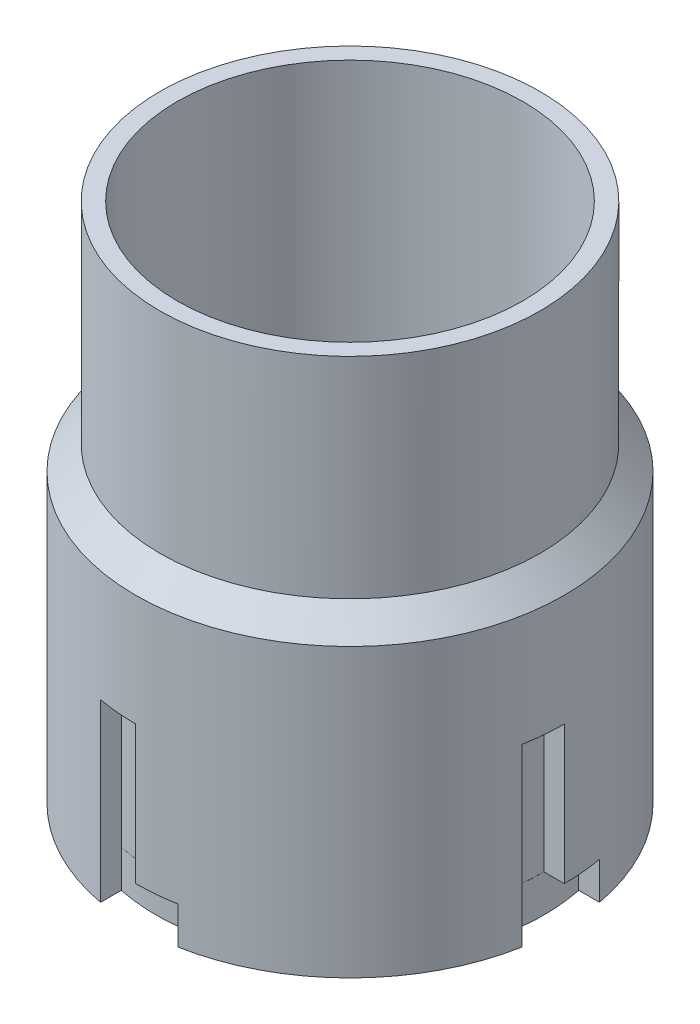
ISO-10303-21;
HEADER;
FILE_DESCRIPTION(('STEP AP214'),'2;1');
FILE_NAME('part.step','',(''),(''),'','','');
FILE_SCHEMA(('AUTOMOTIVE_DESIGN { 1 0 10303 214 1 1 1 1 }'));
ENDSEC;
DATA;
#1=APPLICATION_CONTEXT('core data for automotive mechanical design processes');
#2=APPLICATION_PROTOCOL_DEFINITION('international standard','automotive_design',2000,#1);
#3=PRODUCT_CONTEXT('',#1,'mechanical');
#4=PRODUCT('Part','Part','',(#3));
#5=PRODUCT_RELATED_PRODUCT_CATEGORY('part','',(#4));
#6=PRODUCT_DEFINITION_FORMATION('','',#4);
#7=PRODUCT_DEFINITION_CONTEXT('part definition',#1,'design');
#8=PRODUCT_DEFINITION('design','',#6,#7);
#9=PRODUCT_DEFINITION_SHAPE('','',#8);
#10=(LENGTH_UNIT() NAMED_UNIT(*) SI_UNIT(.MILLI.,.METRE.));
#11=(NAMED_UNIT(*) PLANE_ANGLE_UNIT() SI_UNIT($,.RADIAN.));
#12=(NAMED_UNIT(*) SI_UNIT($,.STERADIAN.) SOLID_ANGLE_UNIT());
#13=UNCERTAINTY_MEASURE_WITH_UNIT(LENGTH_MEASURE(1.E-05),#10,'distance_accuracy_value','');
#14=(GEOMETRIC_REPRESENTATION_CONTEXT(3) GLOBAL_UNCERTAINTY_ASSIGNED_CONTEXT((#13)) GLOBAL_UNIT_ASSIGNED_CONTEXT((#10,
#11,#12)) REPRESENTATION_CONTEXT('',''));
#15=CARTESIAN_POINT('',(0.,0.,0.));
#16=DIRECTION('',(0.,0.,1.));
#17=DIRECTION('',(1.,0.,0.));
#18=AXIS2_PLACEMENT_3D('',#15,#16,#17);
#19=CARTESIAN_POINT('',(0.,101.6,0.));
#20=DIRECTION('',(0.,-1.,0.));
#21=DIRECTION('',(0.,0.,-1.));
#22=AXIS2_PLACEMENT_3D('',#19,#20,#21);
#23=CYLINDRICAL_SURFACE('',#22,39.37);
#24=CARTESIAN_POINT('',(0.,58.5799999999999,0.));
#25=DIRECTION('',(0.,1.,0.));
#26=DIRECTION('',(0.,0.,1.));
#27=AXIS2_PLACEMENT_3D('',#24,#25,#26);
#28=CIRCLE('',#27,39.37);
#29=CARTESIAN_POINT('',(0.,58.5799999999999,39.37));
#30=VERTEX_POINT('',#29);
#31=EDGE_CURVE('E41',#30,#30,#28,.F.);
#32=ORIENTED_EDGE('',*,*,#31,.T.);
#33=EDGE_LOOP('',(#32));
#34=FACE_BOUND('',#33,.T.);
#35=DIRECTION('',(0.,-1.,0.));
#36=VECTOR('',#35,1.);
#37=CARTESIAN_POINT('',(-38.7222979173499,12.7,-7.11199999999987));
#38=LINE('',#37,#36);
#39=CARTESIAN_POINT('',(-38.7222979173499,38.1,-7.11199999999987));
#40=VERTEX_POINT('',#39);
#41=CARTESIAN_POINT('',(-38.7222979173499,5.842,-7.11199999999987));
#42=VERTEX_POINT('',#41);
#43=EDGE_CURVE('E48',#40,#42,#38,.T.);
#44=ORIENTED_EDGE('',*,*,#43,.F.);
#45=CARTESIAN_POINT('',(0.,38.1,0.));
#46=DIRECTION('',(0.,-1.,0.));
#47=DIRECTION('',(-1.,0.,0.));
#48=AXIS2_PLACEMENT_3D('',#45,#46,#47);
#49=CIRCLE('',#48,39.37);
#50=CARTESIAN_POINT('',(-39.37,38.1,1.37459620310254E-13));
#51=VERTEX_POINT('',#50);
#52=EDGE_CURVE('E239',#51,#40,#49,.T.);
#53=ORIENTED_EDGE('',*,*,#52,.F.);
#54=DIRECTION('',(0.,-1.,0.));
#55=VECTOR('',#54,1.);
#56=CARTESIAN_POINT('',(-39.37,38.1,1.37459620310254E-13));
#57=LINE('',#56,#55);
#58=CARTESIAN_POINT('',(-39.37,12.7,1.37459620310254E-13));
#59=VERTEX_POINT('',#58);
#60=EDGE_CURVE('E229',#51,#59,#57,.T.);
#61=ORIENTED_EDGE('',*,*,#60,.T.);
#62=CARTESIAN_POINT('',(0.,12.7,0.));
#63=DIRECTION('',(0.,-1.,0.));
#64=DIRECTION('',(0.,0.,-1.));
#65=AXIS2_PLACEMENT_3D('',#62,#63,#64);
#66=CIRCLE('',#65,39.37);
#67=CARTESIAN_POINT('',(-38.7222979173499,12.7,7.11200000000013));
#68=VERTEX_POINT('',#67);
#69=EDGE_CURVE('E452',#68,#59,#66,.T.);
#70=ORIENTED_EDGE('',*,*,#69,.F.);
#71=DIRECTION('',(0.,-1.,0.));
#72=VECTOR('',#71,1.);
#73=CARTESIAN_POINT('',(-38.7222979173499,12.7,7.11200000000013));
#74=LINE('',#73,#72);
#75=CARTESIAN_POINT('',(-38.7222979173499,5.842,7.11200000000013));
#76=VERTEX_POINT('',#75);
#77=EDGE_CURVE('E312',#68,#76,#74,.T.);
#78=ORIENTED_EDGE('',*,*,#77,.T.);
#79=CARTESIAN_POINT('',(0.,5.842,0.));
#80=DIRECTION('',(0.,-1.,0.));
#81=DIRECTION('',(0.,0.,-1.));
#82=AXIS2_PLACEMENT_3D('',#79,#80,#81);
#83=CIRCLE('',#82,39.37);
#84=CARTESIAN_POINT('',(-7.112,5.842,38.7222979173499));
#85=VERTEX_POINT('',#84);
#86=EDGE_CURVE('E877',#85,#76,#83,.T.);
#87=ORIENTED_EDGE('',*,*,#86,.F.);
#88=DIRECTION('',(0.,-1.,0.));
#89=VECTOR('',#88,1.);
#90=CARTESIAN_POINT('',(-7.112,12.7,38.7222979173499));
#91=LINE('',#90,#89);
#92=CARTESIAN_POINT('',(-7.112,38.1,38.7222979173499));
#93=VERTEX_POINT('',#92);
#94=EDGE_CURVE('E56',#93,#85,#91,.T.);
#95=ORIENTED_EDGE('',*,*,#94,.F.);
#96=CARTESIAN_POINT('',(0.,38.1,0.));
#97=DIRECTION('',(0.,-1.,0.));
#98=DIRECTION('',(0.,0.,1.));
#99=AXIS2_PLACEMENT_3D('',#96,#97,#98);
#100=CIRCLE('',#99,39.37);
#101=CARTESIAN_POINT('',(0.,38.1,39.37));
#102=VERTEX_POINT('',#101);
#103=EDGE_CURVE('E262',#102,#93,#100,.T.);
#104=ORIENTED_EDGE('',*,*,#103,.F.);
#105=DIRECTION('',(0.,-1.,0.));
#106=VECTOR('',#105,1.);
#107=CARTESIAN_POINT('',(0.,38.1,39.37));
#108=LINE('',#107,#106);
#109=CARTESIAN_POINT('',(0.,12.7,39.37));
#110=VERTEX_POINT('',#109);
#111=EDGE_CURVE('E277',#102,#110,#108,.T.);
#112=ORIENTED_EDGE('',*,*,#111,.T.);
#113=CARTESIAN_POINT('',(0.,12.7,0.));
#114=DIRECTION('',(0.,-1.,0.));
#115=DIRECTION('',(0.,0.,-1.));
#116=AXIS2_PLACEMENT_3D('',#113,#114,#115);
#117=CIRCLE('',#116,39.37);
#118=CARTESIAN_POINT('',(7.112,12.7,38.7222979173499));
#119=VERTEX_POINT('',#118);
#120=EDGE_CURVE('E449',#119,#110,#117,.T.);
#121=ORIENTED_EDGE('',*,*,#120,.F.);
#122=DIRECTION('',(0.,-1.,0.));
#123=VECTOR('',#122,1.);
#124=CARTESIAN_POINT('',(7.112,12.7,38.7222979173499));
#125=LINE('',#124,#123);
#126=CARTESIAN_POINT('',(7.112,5.842,38.7222979173499));
#127=VERTEX_POINT('',#126);
#128=EDGE_CURVE('E329',#119,#127,#125,.T.);
#129=ORIENTED_EDGE('',*,*,#128,.T.);
#130=CARTESIAN_POINT('',(38.72229791735,5.842,7.1119999999996));
#131=VERTEX_POINT('',#130);
#132=EDGE_CURVE('E393',#131,#127,#83,.T.);
#133=ORIENTED_EDGE('',*,*,#132,.F.);
#134=DIRECTION('',(0.,-1.,0.));
#135=VECTOR('',#134,1.);
#136=CARTESIAN_POINT('',(38.72229791735,12.7,7.1119999999996));
#137=LINE('',#136,#135);
#138=CARTESIAN_POINT('',(38.72229791735,38.1,7.1119999999996));
#139=VERTEX_POINT('',#138);
#140=EDGE_CURVE('E344',#139,#131,#137,.T.);
#141=ORIENTED_EDGE('',*,*,#140,.F.);
#142=CARTESIAN_POINT('',(0.,38.1,0.));
#143=DIRECTION('',(0.,-1.,0.));
#144=DIRECTION('',(1.,0.,0.));
#145=AXIS2_PLACEMENT_3D('',#142,#143,#144);
#146=CIRCLE('',#145,39.37);
#147=CARTESIAN_POINT('',(39.37,38.1,-4.12378860930763E-13));
#148=VERTEX_POINT('',#147);
#149=EDGE_CURVE('E288',#148,#139,#146,.T.);
#150=ORIENTED_EDGE('',*,*,#149,.F.);
#151=DIRECTION('',(0.,-1.,0.));
#152=VECTOR('',#151,1.);
#153=CARTESIAN_POINT('',(39.37,38.1,-4.12378860930763E-13));
#154=LINE('',#153,#152);
#155=CARTESIAN_POINT('',(39.37,12.7,-4.12378860930763E-13));
#156=VERTEX_POINT('',#155);
#157=EDGE_CURVE('E302',#148,#156,#154,.T.);
#158=ORIENTED_EDGE('',*,*,#157,.T.);
#159=CARTESIAN_POINT('',(0.,12.7,0.));
#160=DIRECTION('',(0.,-1.,0.));
#161=DIRECTION('',(0.,0.,-1.));
#162=AXIS2_PLACEMENT_3D('',#159,#160,#161);
#163=CIRCLE('',#162,39.37);
#164=CARTESIAN_POINT('',(38.7222979173498,12.7,-7.1120000000004));
#165=VERTEX_POINT('',#164);
#166=EDGE_CURVE('E446',#165,#156,#163,.T.);
#167=ORIENTED_EDGE('',*,*,#166,.F.);
#168=DIRECTION('',(0.,-1.,0.));
#169=VECTOR('',#168,1.);
#170=CARTESIAN_POINT('',(38.7222979173498,12.7,-7.1120000000004));
#171=LINE('',#170,#169);
#172=CARTESIAN_POINT('',(38.7222979173498,5.842,-7.1120000000004));
#173=VERTEX_POINT('',#172);
#174=EDGE_CURVE('E345',#165,#173,#171,.T.);
#175=ORIENTED_EDGE('',*,*,#174,.T.);
#176=CARTESIAN_POINT('',(7.112,5.842,-38.7222979173499));
#177=VERTEX_POINT('',#176);
#178=EDGE_CURVE('E389',#177,#173,#83,.T.);
#179=ORIENTED_EDGE('',*,*,#178,.F.);
#180=DIRECTION('',(0.,-1.,0.));
#181=VECTOR('',#180,1.);
#182=CARTESIAN_POINT('',(7.112,12.7,-38.7222979173499));
#183=LINE('',#182,#181);
#184=CARTESIAN_POINT('',(7.112,38.1,-38.7222979173499));
#185=VERTEX_POINT('',#184);
#186=EDGE_CURVE('E403',#185,#177,#183,.T.);
#187=ORIENTED_EDGE('',*,*,#186,.F.);
#188=CARTESIAN_POINT('',(0.,38.1,0.));
#189=DIRECTION('',(0.,-1.,0.));
#190=DIRECTION('',(0.,0.,-1.));
#191=AXIS2_PLACEMENT_3D('',#188,#189,#190);
#192=CIRCLE('',#191,39.37);
#193=CARTESIAN_POINT('',(0.,38.1,-39.37));
#194=VERTEX_POINT('',#193);
#195=EDGE_CURVE('E362',#194,#185,#192,.T.);
#196=ORIENTED_EDGE('',*,*,#195,.F.);
#197=DIRECTION('',(0.,-1.,0.));
#198=VECTOR('',#197,1.);
#199=CARTESIAN_POINT('',(0.,38.1,-39.37));
#200=LINE('',#199,#198);
#201=CARTESIAN_POINT('',(0.,12.7,-39.37));
#202=VERTEX_POINT('',#201);
#203=EDGE_CURVE('E375',#194,#202,#200,.T.);
#204=ORIENTED_EDGE('',*,*,#203,.T.);
#205=CARTESIAN_POINT('',(0.,12.7,0.));
#206=DIRECTION('',(0.,-1.,0.));
#207=DIRECTION('',(0.,0.,-1.));
#208=AXIS2_PLACEMENT_3D('',#205,#206,#207);
#209=CIRCLE('',#208,39.37);
#210=CARTESIAN_POINT('',(-7.112,12.7,-38.7222979173499));
#211=VERTEX_POINT('',#210);
#212=EDGE_CURVE('E421',#211,#202,#209,.T.);
#213=ORIENTED_EDGE('',*,*,#212,.F.);
#214=DIRECTION('',(0.,-1.,0.));
#215=VECTOR('',#214,1.);
#216=CARTESIAN_POINT('',(-7.112,12.7,-38.7222979173499));
#217=LINE('',#216,#215);
#218=CARTESIAN_POINT('',(-7.112,5.842,-38.7222979173499));
#219=VERTEX_POINT('',#218);
#220=EDGE_CURVE('E404',#211,#219,#217,.T.);
#221=ORIENTED_EDGE('',*,*,#220,.T.);
#222=EDGE_CURVE('E388',#42,#219,#83,.T.);
#223=ORIENTED_EDGE('',*,*,#222,.F.);
#224=EDGE_LOOP('',(#44,#53,#61,#70,#78,#87,#95,#104,#112,#121,#129,#133,#141,#150,#158,#167,
#175,#179,#187,#196,#204,#213,#221,#223));
#225=FACE_BOUND('',#224,.T.);
#226=ADVANCED_FACE('F33',(#34,#225),#23,.T.);
#227=CARTESIAN_POINT('',(0.,0.,0.));
#228=DIRECTION('',(0.,1.,0.));
#229=DIRECTION('',(0.,0.,1.));
#230=AXIS2_PLACEMENT_3D('',#227,#228,#229);
#231=CYLINDRICAL_SURFACE('',#230,31.75);
#232=CARTESIAN_POINT('',(0.,101.6,0.));
#233=DIRECTION('',(0.,1.,0.));
#234=DIRECTION('',(0.,0.,1.));
#235=AXIS2_PLACEMENT_3D('',#232,#233,#234);
#236=CIRCLE('',#235,31.75);
#237=CARTESIAN_POINT('',(0.,101.6,31.75));
#238=VERTEX_POINT('',#237);
#239=EDGE_CURVE('E418',#238,#238,#236,.T.);
#240=ORIENTED_EDGE('',*,*,#239,.T.);
#241=EDGE_LOOP('',(#240));
#242=FACE_BOUND('',#241,.T.);
#243=CARTESIAN_POINT('',(0.,5.842,0.));
#244=DIRECTION('',(0.,-1.,0.));
#245=DIRECTION('',(0.,0.,-1.));
#246=AXIS2_PLACEMENT_3D('',#243,#244,#245);
#247=CIRCLE('',#246,31.75);
#248=CARTESIAN_POINT('',(0.,5.842,-31.75));
#249=VERTEX_POINT('',#248);
#250=EDGE_CURVE('E392',#249,#249,#247,.F.);
#251=ORIENTED_EDGE('',*,*,#250,.F.);
#252=EDGE_LOOP('',(#251));
#253=FACE_BOUND('',#252,.T.);
#254=ADVANCED_FACE('F485',(#242,#253),#231,.F.);
#255=CARTESIAN_POINT('',(-7.112,12.7,-34.9122979173499));
#256=DIRECTION('',(-1.,0.,0.));
#257=DIRECTION('',(0.,0.,1.));
#258=AXIS2_PLACEMENT_3D('',#255,#256,#257);
#259=PLANE('',#258);
#260=DIRECTION('',(0.,0.,1.));
#261=VECTOR('',#260,1.);
#262=CARTESIAN_POINT('',(-7.112,5.842,-34.9122979173499));
#263=LINE('',#262,#261);
#264=CARTESIAN_POINT('',(-7.112,5.842,-34.9122979173499));
#265=VERTEX_POINT('',#264);
#266=EDGE_CURVE('E386',#219,#265,#263,.T.);
#267=ORIENTED_EDGE('',*,*,#266,.F.);
#268=ORIENTED_EDGE('',*,*,#220,.F.);
#269=DIRECTION('',(0.,0.,-1.));
#270=VECTOR('',#269,1.);
#271=CARTESIAN_POINT('',(-7.112,12.7,-34.9122979173499));
#272=LINE('',#271,#270);
#273=CARTESIAN_POINT('',(-7.112,12.7,-34.9122979173499));
#274=VERTEX_POINT('',#273);
#275=EDGE_CURVE('E400',#274,#211,#272,.T.);
#276=ORIENTED_EDGE('',*,*,#275,.F.);
#277=DIRECTION('',(0.,-1.,0.));
#278=VECTOR('',#277,1.);
#279=CARTESIAN_POINT('',(-7.112,12.7,-34.9122979173499));
#280=LINE('',#279,#278);
#281=EDGE_CURVE('E408',#274,#265,#280,.T.);
#282=ORIENTED_EDGE('',*,*,#281,.T.);
#283=EDGE_LOOP('',(#267,#268,#276,#282));
#284=FACE_BOUND('',#283,.T.);
#285=ADVANCED_FACE('F489',(#284),#259,.F.);
#286=CARTESIAN_POINT('',(0.,12.7,-0.645800166113555));
#287=DIRECTION('',(0.,-1.,0.));
#288=DIRECTION('',(0.,0.,-1.));
#289=AXIS2_PLACEMENT_3D('',#286,#287,#288);
#290=CYLINDRICAL_SURFACE('',#289,34.9967628808078);
#291=CARTESIAN_POINT('',(0.,5.842,-0.645800166113555));
#292=DIRECTION('',(0.,-1.,0.));
#293=DIRECTION('',(0.,0.,-1.));
#294=AXIS2_PLACEMENT_3D('',#291,#292,#293);
#295=CIRCLE('',#294,34.9967628808078);
#296=CARTESIAN_POINT('',(7.11199999999999,5.842,-34.9122979173499));
#297=VERTEX_POINT('',#296);
#298=EDGE_CURVE('E382',#265,#297,#295,.T.);
#299=ORIENTED_EDGE('',*,*,#298,.F.);
#300=ORIENTED_EDGE('',*,*,#281,.F.);
#301=CARTESIAN_POINT('',(0.,12.7,-0.645800166113555));
#302=DIRECTION('',(0.,1.,0.));
#303=DIRECTION('',(0.,0.,1.));
#304=AXIS2_PLACEMENT_3D('',#301,#302,#303);
#305=CIRCLE('',#304,34.9967628808078);
#306=CARTESIAN_POINT('',(0.,12.7,-35.6425630469213));
#307=VERTEX_POINT('',#306);
#308=EDGE_CURVE('E396',#307,#274,#305,.T.);
#309=ORIENTED_EDGE('',*,*,#308,.F.);
#310=CARTESIAN_POINT('',(7.11199999999999,12.7,-34.9122979173499));
#311=VERTEX_POINT('',#310);
#312=EDGE_CURVE('E397',#311,#307,#305,.T.);
#313=ORIENTED_EDGE('',*,*,#312,.F.);
#314=DIRECTION('',(0.,-1.,0.));
#315=VECTOR('',#314,1.);
#316=CARTESIAN_POINT('',(7.11199999999999,12.7,-34.9122979173499));
#317=LINE('',#316,#315);
#318=EDGE_CURVE('E411',#311,#297,#317,.T.);
#319=ORIENTED_EDGE('',*,*,#318,.T.);
#320=EDGE_LOOP('',(#299,#300,#309,#313,#319));
#321=FACE_BOUND('',#320,.T.);
#322=ADVANCED_FACE('F479',(#321),#290,.T.);
#323=CARTESIAN_POINT('',(7.112,12.7,-34.9122979173499));
#324=DIRECTION('',(1.,0.,0.));
#325=DIRECTION('',(0.,0.,-1.));
#326=AXIS2_PLACEMENT_3D('',#323,#324,#325);
#327=PLANE('',#326);
#328=DIRECTION('',(0.,0.,-1.));
#329=VECTOR('',#328,1.);
#330=CARTESIAN_POINT('',(7.112,5.842,-34.9122979173499));
#331=LINE('',#330,#329);
#332=EDGE_CURVE('E424',#297,#177,#331,.T.);
#333=ORIENTED_EDGE('',*,*,#332,.F.);
#334=ORIENTED_EDGE('',*,*,#318,.F.);
#335=DIRECTION('',(0.,-1.,0.));
#336=VECTOR('',#335,1.);
#337=CARTESIAN_POINT('',(7.11199999999999,38.1,-34.9122979173499));
#338=LINE('',#337,#336);
#339=CARTESIAN_POINT('',(7.11199999999999,38.1,-34.9122979173499));
#340=VERTEX_POINT('',#339);
#341=EDGE_CURVE('E372',#340,#311,#338,.T.);
#342=ORIENTED_EDGE('',*,*,#341,.F.);
#343=DIRECTION('',(0.,0.,1.));
#344=VECTOR('',#343,1.);
#345=CARTESIAN_POINT('',(7.112,38.1,-38.7222979173499));
#346=LINE('',#345,#344);
#347=EDGE_CURVE('E365',#185,#340,#346,.T.);
#348=ORIENTED_EDGE('',*,*,#347,.F.);
#349=ORIENTED_EDGE('',*,*,#186,.T.);
#350=EDGE_LOOP('',(#333,#334,#342,#348,#349));
#351=FACE_BOUND('',#350,.T.);
#352=ADVANCED_FACE('F473',(#351),#327,.F.);
#353=CARTESIAN_POINT('',(0.,101.6,0.));
#354=DIRECTION('',(0.,1.,0.));
#355=DIRECTION('',(0.,0.,1.));
#356=AXIS2_PLACEMENT_3D('',#353,#354,#355);
#357=PLANE('',#356);
#358=ORIENTED_EDGE('',*,*,#239,.F.);
#359=EDGE_LOOP('',(#358));
#360=FACE_BOUND('',#359,.T.);
#361=CARTESIAN_POINT('',(0.,101.6,0.));
#362=DIRECTION('',(0.,1.,0.));
#363=DIRECTION('',(0.,0.,1.));
#364=AXIS2_PLACEMENT_3D('',#361,#362,#363);
#365=CIRCLE('',#364,34.925);
#366=CARTESIAN_POINT('',(0.,101.6,34.925));
#367=VERTEX_POINT('',#366);
#368=EDGE_CURVE('E407',#367,#367,#365,.T.);
#369=ORIENTED_EDGE('',*,*,#368,.T.);
#370=EDGE_LOOP('',(#369));
#371=FACE_BOUND('',#370,.T.);
#372=ADVANCED_FACE('F468',(#360,#371),#357,.T.);
#373=CARTESIAN_POINT('',(0.,68.58,0.));
#374=DIRECTION('',(0.,1.,0.));
#375=DIRECTION('',(0.,0.,1.));
#376=AXIS2_PLACEMENT_3D('',#373,#374,#375);
#377=CYLINDRICAL_SURFACE('',#376,34.925);
#378=CARTESIAN_POINT('',(0.,63.0249999999999,0.));
#379=DIRECTION('',(0.,-1.,0.));
#380=DIRECTION('',(0.,0.,-1.));
#381=AXIS2_PLACEMENT_3D('',#378,#379,#380);
#382=CIRCLE('',#381,34.925);
#383=CARTESIAN_POINT('',(0.,63.0249999999999,-34.925));
#384=VERTEX_POINT('',#383);
#385=EDGE_CURVE('E11',#384,#384,#382,.F.);
#386=ORIENTED_EDGE('',*,*,#385,.T.);
#387=EDGE_LOOP('',(#386));
#388=FACE_BOUND('',#387,.T.);
#389=ORIENTED_EDGE('',*,*,#368,.F.);
#390=EDGE_LOOP('',(#389));
#391=FACE_BOUND('',#390,.T.);
#392=ADVANCED_FACE('F464',(#388,#391),#377,.T.);
#393=CARTESIAN_POINT('',(0.,12.7,-0.645800166113555));
#394=DIRECTION('',(0.,-1.,0.));
#395=DIRECTION('',(0.,0.,-1.));
#396=AXIS2_PLACEMENT_3D('',#393,#394,#395);
#397=PLANE('',#396);
#398=DIRECTION('',(0.,0.,-1.));
#399=VECTOR('',#398,1.);
#400=CARTESIAN_POINT('',(0.,12.7,-0.645800166113555));
#401=LINE('',#400,#399);
#402=EDGE_CURVE('E426',#307,#202,#401,.T.);
#403=ORIENTED_EDGE('',*,*,#402,.F.);
#404=ORIENTED_EDGE('',*,*,#308,.T.);
#405=ORIENTED_EDGE('',*,*,#275,.T.);
#406=ORIENTED_EDGE('',*,*,#212,.T.);
#407=EDGE_LOOP('',(#403,#404,#405,#406));
#408=FACE_BOUND('',#407,.T.);
#409=ADVANCED_FACE('F467',(#408),#397,.T.);
#410=CARTESIAN_POINT('',(0.,5.842,0.));
#411=DIRECTION('',(0.,-1.,0.));
#412=DIRECTION('',(0.,0.,-1.));
#413=AXIS2_PLACEMENT_3D('',#410,#411,#412);
#414=PLANE('',#413);
#415=DIRECTION('',(-1.,0.,0.));
#416=VECTOR('',#415,1.);
#417=CARTESIAN_POINT('',(0.,5.842,7.11200000000002));
#418=LINE('',#417,#416);
#419=CARTESIAN_POINT('',(-34.9122979173499,5.842,7.11200000000012));
#420=VERTEX_POINT('',#419);
#421=EDGE_CURVE('E444',#420,#76,#418,.T.);
#422=ORIENTED_EDGE('',*,*,#421,.F.);
#423=CARTESIAN_POINT('',(-0.645800166113555,5.842,0.));
#424=DIRECTION('',(0.,-1.,0.));
#425=DIRECTION('',(0.,0.,-1.));
#426=AXIS2_PLACEMENT_3D('',#423,#424,#425);
#427=CIRCLE('',#426,34.9967628808078);
#428=CARTESIAN_POINT('',(-34.9122979173499,5.842,-7.11199999999987));
#429=VERTEX_POINT('',#428);
#430=EDGE_CURVE('E442',#429,#420,#427,.F.);
#431=ORIENTED_EDGE('',*,*,#430,.F.);
#432=DIRECTION('',(1.,0.,0.));
#433=VECTOR('',#432,1.);
#434=CARTESIAN_POINT('',(0.,5.842,-7.112));
#435=LINE('',#434,#433);
#436=EDGE_CURVE('E440',#42,#429,#435,.T.);
#437=ORIENTED_EDGE('',*,*,#436,.F.);
#438=ORIENTED_EDGE('',*,*,#222,.T.);
#439=ORIENTED_EDGE('',*,*,#266,.T.);
#440=ORIENTED_EDGE('',*,*,#298,.T.);
#441=ORIENTED_EDGE('',*,*,#332,.T.);
#442=ORIENTED_EDGE('',*,*,#178,.T.);
#443=DIRECTION('',(1.,0.,0.));
#444=VECTOR('',#443,1.);
#445=CARTESIAN_POINT('',(0.,5.842,-7.11200000000002));
#446=LINE('',#445,#444);
#447=CARTESIAN_POINT('',(34.9122979173498,5.842,-7.11200000000036));
#448=VERTEX_POINT('',#447);
#449=EDGE_CURVE('E432',#448,#173,#446,.T.);
#450=ORIENTED_EDGE('',*,*,#449,.F.);
#451=CARTESIAN_POINT('',(0.645800166113555,5.842,0.));
#452=DIRECTION('',(0.,-1.,0.));
#453=DIRECTION('',(0.,0.,-1.));
#454=AXIS2_PLACEMENT_3D('',#451,#452,#453);
#455=CIRCLE('',#454,34.9967628808078);
#456=CARTESIAN_POINT('',(34.91229791735,5.842,7.11199999999963));
#457=VERTEX_POINT('',#456);
#458=EDGE_CURVE('E430',#457,#448,#455,.F.);
#459=ORIENTED_EDGE('',*,*,#458,.F.);
#460=DIRECTION('',(-1.,0.,0.));
#461=VECTOR('',#460,1.);
#462=CARTESIAN_POINT('',(0.,5.842,7.112));
#463=LINE('',#462,#461);
#464=EDGE_CURVE('E428',#131,#457,#463,.T.);
#465=ORIENTED_EDGE('',*,*,#464,.F.);
#466=ORIENTED_EDGE('',*,*,#132,.T.);
#467=DIRECTION('',(0.,0.,1.));
#468=VECTOR('',#467,1.);
#469=CARTESIAN_POINT('',(7.11200000000001,5.842,0.));
#470=LINE('',#469,#468);
#471=CARTESIAN_POINT('',(7.112,5.842,34.9122979173499));
#472=VERTEX_POINT('',#471);
#473=EDGE_CURVE('E438',#472,#127,#470,.T.);
#474=ORIENTED_EDGE('',*,*,#473,.F.);
#475=CARTESIAN_POINT('',(0.,5.842,0.645800166113555));
#476=DIRECTION('',(0.,-1.,0.));
#477=DIRECTION('',(0.,0.,-1.));
#478=AXIS2_PLACEMENT_3D('',#475,#476,#477);
#479=CIRCLE('',#478,34.9967628808078);
#480=CARTESIAN_POINT('',(-7.11199999999999,5.842,34.9122979173499));
#481=VERTEX_POINT('',#480);
#482=EDGE_CURVE('E436',#481,#472,#479,.F.);
#483=ORIENTED_EDGE('',*,*,#482,.F.);
#484=DIRECTION('',(0.,0.,-1.));
#485=VECTOR('',#484,1.);
#486=CARTESIAN_POINT('',(-7.112,5.842,0.));
#487=LINE('',#486,#485);
#488=EDGE_CURVE('E434',#85,#481,#487,.T.);
#489=ORIENTED_EDGE('',*,*,#488,.F.);
#490=ORIENTED_EDGE('',*,*,#86,.T.);
#491=EDGE_LOOP('',(#422,#431,#437,#438,#439,#440,#441,#442,#450,#459,#465,#466,#474,#483,#489,#490));
#492=FACE_BOUND('',#491,.T.);
#493=CARTESIAN_POINT('',(-22.3185825373733,5.842,-27.0797934603451));
#494=DIRECTION('',(0.,-1.,0.));
#495=DIRECTION('',(0.,0.,-1.));
#496=AXIS2_PLACEMENT_3D('',#493,#494,#495);
#497=CIRCLE('',#496,3.26827124590955);
#498=CARTESIAN_POINT('',(-22.3185825373733,5.842,-30.3480647062546));
#499=VERTEX_POINT('',#498);
#500=EDGE_CURVE('E374',#499,#499,#497,.T.);
#501=ORIENTED_EDGE('',*,*,#500,.F.);
#502=EDGE_LOOP('',(#501));
#503=FACE_BOUND('',#502,.T.);
#504=ORIENTED_EDGE('',*,*,#250,.T.);
#505=EDGE_LOOP('',(#504));
#506=FACE_BOUND('',#505,.T.);
#507=ADVANCED_FACE('F503',(#492,#503,#506),#414,.T.);
#508=CARTESIAN_POINT('',(-22.3185825373733,-4.318,-27.0797934603451));
#509=DIRECTION('',(0.,1.,0.));
#510=DIRECTION('',(0.,0.,1.));
#511=AXIS2_PLACEMENT_3D('',#508,#509,#510);
#512=CYLINDRICAL_SURFACE('',#511,3.26827124590955);
#513=CARTESIAN_POINT('',(-22.3185825373733,-4.318,-27.0797934603451));
#514=DIRECTION('',(0.,-1.,0.));
#515=DIRECTION('',(0.,0.,-1.));
#516=AXIS2_PLACEMENT_3D('',#513,#514,#515);
#517=CIRCLE('',#516,3.26827124590955);
#518=CARTESIAN_POINT('',(-22.3185825373733,-4.318,-30.3480647062546));
#519=VERTEX_POINT('',#518);
#520=EDGE_CURVE('E379',#519,#519,#517,.T.);
#521=ORIENTED_EDGE('',*,*,#520,.F.);
#522=EDGE_LOOP('',(#521));
#523=FACE_BOUND('',#522,.T.);
#524=ORIENTED_EDGE('',*,*,#500,.T.);
#525=EDGE_LOOP('',(#524));
#526=FACE_BOUND('',#525,.T.);
#527=ADVANCED_FACE('F507',(#523,#526),#512,.T.);
#528=CARTESIAN_POINT('',(-22.3185825373733,-4.318,-27.0797934603451));
#529=DIRECTION('',(0.,-1.,0.));
#530=DIRECTION('',(0.,0.,-1.));
#531=AXIS2_PLACEMENT_3D('',#528,#529,#530);
#532=PLANE('',#531);
#533=ORIENTED_EDGE('',*,*,#520,.T.);
#534=EDGE_LOOP('',(#533));
#535=FACE_BOUND('',#534,.T.);
#536=ADVANCED_FACE('F511',(#535),#532,.T.);
#537=CARTESIAN_POINT('',(0.,12.7,0.));
#538=DIRECTION('',(0.,1.,0.));
#539=DIRECTION('',(0.,0.,1.));
#540=AXIS2_PLACEMENT_3D('',#537,#538,#539);
#541=PLANE('',#540);
#542=ORIENTED_EDGE('',*,*,#312,.T.);
#543=DIRECTION('',(0.,0.,-1.));
#544=VECTOR('',#543,1.);
#545=CARTESIAN_POINT('',(0.,12.7,-39.37));
#546=LINE('',#545,#544);
#547=CARTESIAN_POINT('',(0.,12.7,-35.6293290684766));
#548=VERTEX_POINT('',#547);
#549=EDGE_CURVE('E359',#548,#307,#546,.T.);
#550=ORIENTED_EDGE('',*,*,#549,.F.);
#551=CARTESIAN_POINT('',(0.,12.7,0.));
#552=DIRECTION('',(0.,1.,0.));
#553=DIRECTION('',(0.,0.,1.));
#554=AXIS2_PLACEMENT_3D('',#551,#552,#553);
#555=CIRCLE('',#554,35.6293290684766);
#556=EDGE_CURVE('E315',#311,#548,#555,.T.);
#557=ORIENTED_EDGE('',*,*,#556,.F.);
#558=EDGE_LOOP('',(#542,#550,#557));
#559=FACE_BOUND('',#558,.T.);
#560=ADVANCED_FACE('F515',(#559),#541,.T.);
#561=CARTESIAN_POINT('',(0.,38.1,0.));
#562=DIRECTION('',(0.,-1.,0.));
#563=DIRECTION('',(0.,0.,-1.));
#564=AXIS2_PLACEMENT_3D('',#561,#562,#563);
#565=CYLINDRICAL_SURFACE('',#564,35.6293290684766);
#566=ORIENTED_EDGE('',*,*,#556,.T.);
#567=DIRECTION('',(0.,-1.,0.));
#568=VECTOR('',#567,1.);
#569=CARTESIAN_POINT('',(0.,38.1,-35.6293290684766));
#570=LINE('',#569,#568);
#571=CARTESIAN_POINT('',(0.,38.1,-35.6293290684766));
#572=VERTEX_POINT('',#571);
#573=EDGE_CURVE('E368',#572,#548,#570,.T.);
#574=ORIENTED_EDGE('',*,*,#573,.F.);
#575=CARTESIAN_POINT('',(0.,38.1,0.));
#576=DIRECTION('',(0.,1.,0.));
#577=DIRECTION('',(0.,0.,1.));
#578=AXIS2_PLACEMENT_3D('',#575,#576,#577);
#579=CIRCLE('',#578,35.6293290684766);
#580=EDGE_CURVE('E355',#340,#572,#579,.T.);
#581=ORIENTED_EDGE('',*,*,#580,.F.);
#582=ORIENTED_EDGE('',*,*,#341,.T.);
#583=EDGE_LOOP('',(#566,#574,#581,#582));
#584=FACE_BOUND('',#583,.T.);
#585=ADVANCED_FACE('F517',(#584),#565,.T.);
#586=CARTESIAN_POINT('',(0.,38.1,-39.37));
#587=DIRECTION('',(-1.,0.,0.));
#588=DIRECTION('',(0.,0.,1.));
#589=AXIS2_PLACEMENT_3D('',#586,#587,#588);
#590=PLANE('',#589);
#591=ORIENTED_EDGE('',*,*,#549,.T.);
#592=ORIENTED_EDGE('',*,*,#402,.T.);
#593=ORIENTED_EDGE('',*,*,#203,.F.);
#594=DIRECTION('',(0.,0.,-1.));
#595=VECTOR('',#594,1.);
#596=CARTESIAN_POINT('',(0.,38.1,-39.37));
#597=LINE('',#596,#595);
#598=EDGE_CURVE('E358',#572,#194,#597,.T.);
#599=ORIENTED_EDGE('',*,*,#598,.F.);
#600=ORIENTED_EDGE('',*,*,#573,.T.);
#601=EDGE_LOOP('',(#591,#592,#593,#599,#600));
#602=FACE_BOUND('',#601,.T.);
#603=ADVANCED_FACE('F520',(#602),#590,.F.);
#604=CARTESIAN_POINT('',(0.,38.1,0.));
#605=DIRECTION('',(0.,1.,0.));
#606=DIRECTION('',(0.,0.,1.));
#607=AXIS2_PLACEMENT_3D('',#604,#605,#606);
#608=PLANE('',#607);
#609=ORIENTED_EDGE('',*,*,#580,.T.);
#610=ORIENTED_EDGE('',*,*,#598,.T.);
#611=ORIENTED_EDGE('',*,*,#195,.T.);
#612=ORIENTED_EDGE('',*,*,#347,.T.);
#613=EDGE_LOOP('',(#609,#610,#611,#612));
#614=FACE_BOUND('',#613,.T.);
#615=ADVANCED_FACE('F524',(#614),#608,.F.);
#616=CARTESIAN_POINT('',(0.645800166113555,12.7,0.));
#617=DIRECTION('',(0.,-1.,0.));
#618=DIRECTION('',(1.,0.,0.));
#619=AXIS2_PLACEMENT_3D('',#616,#617,#618);
#620=PLANE('',#619);
#621=DIRECTION('',(1.,0.,0.));
#622=VECTOR('',#621,1.);
#623=CARTESIAN_POINT('',(39.37,12.7,-4.12378860930763E-13));
#624=LINE('',#623,#622);
#625=CARTESIAN_POINT('',(35.6425630469213,12.7,-3.73336031240597E-13));
#626=VERTEX_POINT('',#625);
#627=EDGE_CURVE('E298',#626,#156,#624,.T.);
#628=ORIENTED_EDGE('',*,*,#627,.F.);
#629=CARTESIAN_POINT('',(0.645800166113555,12.7,0.));
#630=DIRECTION('',(0.,1.,0.));
#631=DIRECTION('',(-1.,0.,0.));
#632=AXIS2_PLACEMENT_3D('',#629,#630,#631);
#633=CIRCLE('',#632,34.9967628808078);
#634=CARTESIAN_POINT('',(34.9122979173498,12.7,-7.11200000000036));
#635=VERTEX_POINT('',#634);
#636=EDGE_CURVE('E253',#626,#635,#633,.T.);
#637=ORIENTED_EDGE('',*,*,#636,.T.);
#638=DIRECTION('',(1.,0.,0.));
#639=VECTOR('',#638,1.);
#640=CARTESIAN_POINT('',(34.9122979173498,12.7,-7.11200000000036));
#641=LINE('',#640,#639);
#642=EDGE_CURVE('E341',#635,#165,#641,.T.);
#643=ORIENTED_EDGE('',*,*,#642,.T.);
#644=ORIENTED_EDGE('',*,*,#166,.T.);
#645=EDGE_LOOP('',(#628,#637,#643,#644));
#646=FACE_BOUND('',#645,.T.);
#647=ADVANCED_FACE('F531',(#646),#620,.T.);
#648=CARTESIAN_POINT('',(34.9122979173498,12.7,-7.11200000000036));
#649=DIRECTION('',(0.,0.,-1.));
#650=DIRECTION('',(-1.,0.,0.));
#651=AXIS2_PLACEMENT_3D('',#648,#649,#650);
#652=PLANE('',#651);
#653=ORIENTED_EDGE('',*,*,#449,.T.);
#654=ORIENTED_EDGE('',*,*,#174,.F.);
#655=ORIENTED_EDGE('',*,*,#642,.F.);
#656=DIRECTION('',(0.,-1.,0.));
#657=VECTOR('',#656,1.);
#658=CARTESIAN_POINT('',(34.9122979173498,12.7,-7.11200000000036));
#659=LINE('',#658,#657);
#660=EDGE_CURVE('E348',#635,#448,#659,.T.);
#661=ORIENTED_EDGE('',*,*,#660,.T.);
#662=EDGE_LOOP('',(#653,#654,#655,#661));
#663=FACE_BOUND('',#662,.T.);
#664=ADVANCED_FACE('F541',(#663),#652,.F.);
#665=CARTESIAN_POINT('',(0.645800166113555,12.7,0.));
#666=DIRECTION('',(0.,-1.,0.));
#667=DIRECTION('',(0.,0.,-1.));
#668=AXIS2_PLACEMENT_3D('',#665,#666,#667);
#669=CYLINDRICAL_SURFACE('',#668,34.9967628808078);
#670=ORIENTED_EDGE('',*,*,#458,.T.);
#671=ORIENTED_EDGE('',*,*,#660,.F.);
#672=ORIENTED_EDGE('',*,*,#636,.F.);
#673=CARTESIAN_POINT('',(34.91229791735,12.7,7.11199999999963));
#674=VERTEX_POINT('',#673);
#675=EDGE_CURVE('E339',#674,#626,#633,.T.);
#676=ORIENTED_EDGE('',*,*,#675,.F.);
#677=DIRECTION('',(0.,-1.,0.));
#678=VECTOR('',#677,1.);
#679=CARTESIAN_POINT('',(34.91229791735,12.7,7.11199999999963));
#680=LINE('',#679,#678);
#681=EDGE_CURVE('E351',#674,#457,#680,.T.);
#682=ORIENTED_EDGE('',*,*,#681,.T.);
#683=EDGE_LOOP('',(#670,#671,#672,#676,#682));
#684=FACE_BOUND('',#683,.T.);
#685=ADVANCED_FACE('F537',(#684),#669,.T.);
#686=CARTESIAN_POINT('',(34.91229791735,12.7,7.11199999999964));
#687=DIRECTION('',(0.,0.,1.));
#688=DIRECTION('',(1.,0.,0.));
#689=AXIS2_PLACEMENT_3D('',#686,#687,#688);
#690=PLANE('',#689);
#691=ORIENTED_EDGE('',*,*,#464,.T.);
#692=ORIENTED_EDGE('',*,*,#681,.F.);
#693=DIRECTION('',(0.,-1.,0.));
#694=VECTOR('',#693,1.);
#695=CARTESIAN_POINT('',(34.91229791735,38.1,7.11199999999963));
#696=LINE('',#695,#694);
#697=CARTESIAN_POINT('',(34.91229791735,38.1,7.11199999999963));
#698=VERTEX_POINT('',#697);
#699=EDGE_CURVE('E273',#698,#674,#696,.T.);
#700=ORIENTED_EDGE('',*,*,#699,.F.);
#701=DIRECTION('',(-1.,0.,0.));
#702=VECTOR('',#701,1.);
#703=CARTESIAN_POINT('',(38.72229791735,38.1,7.1119999999996));
#704=LINE('',#703,#702);
#705=EDGE_CURVE('E291',#139,#698,#704,.T.);
#706=ORIENTED_EDGE('',*,*,#705,.F.);
#707=ORIENTED_EDGE('',*,*,#140,.T.);
#708=EDGE_LOOP('',(#691,#692,#700,#706,#707));
#709=FACE_BOUND('',#708,.T.);
#710=ADVANCED_FACE('F533',(#709),#690,.F.);
#711=CARTESIAN_POINT('',(0.,12.7,0.645800166113555));
#712=DIRECTION('',(0.,-1.,0.));
#713=DIRECTION('',(0.,0.,1.));
#714=AXIS2_PLACEMENT_3D('',#711,#712,#713);
#715=PLANE('',#714);
#716=DIRECTION('',(0.,0.,1.));
#717=VECTOR('',#716,1.);
#718=CARTESIAN_POINT('',(0.,12.7,39.37));
#719=LINE('',#718,#717);
#720=CARTESIAN_POINT('',(0.,12.7,35.6425630469213));
#721=VERTEX_POINT('',#720);
#722=EDGE_CURVE('E272',#721,#110,#719,.T.);
#723=ORIENTED_EDGE('',*,*,#722,.F.);
#724=CARTESIAN_POINT('',(0.,12.7,0.645800166113555));
#725=DIRECTION('',(0.,1.,0.));
#726=DIRECTION('',(0.,0.,-1.));
#727=AXIS2_PLACEMENT_3D('',#724,#725,#726);
#728=CIRCLE('',#727,34.9967628808078);
#729=CARTESIAN_POINT('',(7.112,12.7,34.9122979173499));
#730=VERTEX_POINT('',#729);
#731=EDGE_CURVE('E326',#721,#730,#728,.T.);
#732=ORIENTED_EDGE('',*,*,#731,.T.);
#733=DIRECTION('',(0.,0.,1.));
#734=VECTOR('',#733,1.);
#735=CARTESIAN_POINT('',(7.112,12.7,34.9122979173499));
#736=LINE('',#735,#734);
#737=EDGE_CURVE('E325',#730,#119,#736,.T.);
#738=ORIENTED_EDGE('',*,*,#737,.T.);
#739=ORIENTED_EDGE('',*,*,#120,.T.);
#740=EDGE_LOOP('',(#723,#732,#738,#739));
#741=FACE_BOUND('',#740,.T.);
#742=ADVANCED_FACE('F536',(#741),#715,.T.);
#743=CARTESIAN_POINT('',(7.112,12.7,34.9122979173499));
#744=DIRECTION('',(1.,0.,0.));
#745=DIRECTION('',(0.,0.,-1.));
#746=AXIS2_PLACEMENT_3D('',#743,#744,#745);
#747=PLANE('',#746);
#748=ORIENTED_EDGE('',*,*,#473,.T.);
#749=ORIENTED_EDGE('',*,*,#128,.F.);
#750=ORIENTED_EDGE('',*,*,#737,.F.);
#751=DIRECTION('',(0.,-1.,0.));
#752=VECTOR('',#751,1.);
#753=CARTESIAN_POINT('',(7.112,12.7,34.9122979173499));
#754=LINE('',#753,#752);
#755=EDGE_CURVE('E332',#730,#472,#754,.T.);
#756=ORIENTED_EDGE('',*,*,#755,.T.);
#757=EDGE_LOOP('',(#748,#749,#750,#756));
#758=FACE_BOUND('',#757,.T.);
#759=ADVANCED_FACE('F556',(#758),#747,.F.);
#760=CARTESIAN_POINT('',(0.,12.7,0.645800166113555));
#761=DIRECTION('',(0.,-1.,0.));
#762=DIRECTION('',(0.,0.,-1.));
#763=AXIS2_PLACEMENT_3D('',#760,#761,#762);
#764=CYLINDRICAL_SURFACE('',#763,34.9967628808078);
#765=ORIENTED_EDGE('',*,*,#482,.T.);
#766=ORIENTED_EDGE('',*,*,#755,.F.);
#767=ORIENTED_EDGE('',*,*,#731,.F.);
#768=CARTESIAN_POINT('',(-7.11199999999999,12.7,34.9122979173499));
#769=VERTEX_POINT('',#768);
#770=EDGE_CURVE('E323',#769,#721,#728,.T.);
#771=ORIENTED_EDGE('',*,*,#770,.F.);
#772=DIRECTION('',(0.,-1.,0.));
#773=VECTOR('',#772,1.);
#774=CARTESIAN_POINT('',(-7.11199999999999,12.7,34.9122979173499));
#775=LINE('',#774,#773);
#776=EDGE_CURVE('E335',#769,#481,#775,.T.);
#777=ORIENTED_EDGE('',*,*,#776,.T.);
#778=EDGE_LOOP('',(#765,#766,#767,#771,#777));
#779=FACE_BOUND('',#778,.T.);
#780=ADVANCED_FACE('F553',(#779),#764,.T.);
#781=CARTESIAN_POINT('',(-7.112,12.7,34.9122979173499));
#782=DIRECTION('',(-1.,0.,0.));
#783=DIRECTION('',(0.,0.,1.));
#784=AXIS2_PLACEMENT_3D('',#781,#782,#783);
#785=PLANE('',#784);
#786=ORIENTED_EDGE('',*,*,#488,.T.);
#787=ORIENTED_EDGE('',*,*,#776,.F.);
#788=DIRECTION('',(0.,-1.,0.));
#789=VECTOR('',#788,1.);
#790=CARTESIAN_POINT('',(-7.11199999999999,38.1,34.9122979173499));
#791=LINE('',#790,#789);
#792=CARTESIAN_POINT('',(-7.11199999999999,38.1,34.9122979173499));
#793=VERTEX_POINT('',#792);
#794=EDGE_CURVE('E249',#793,#769,#791,.T.);
#795=ORIENTED_EDGE('',*,*,#794,.F.);
#796=DIRECTION('',(0.,0.,-1.));
#797=VECTOR('',#796,1.);
#798=CARTESIAN_POINT('',(-7.112,38.1,38.7222979173499));
#799=LINE('',#798,#797);
#800=EDGE_CURVE('E265',#93,#793,#799,.T.);
#801=ORIENTED_EDGE('',*,*,#800,.F.);
#802=ORIENTED_EDGE('',*,*,#94,.T.);
#803=EDGE_LOOP('',(#786,#787,#795,#801,#802));
#804=FACE_BOUND('',#803,.T.);
#805=ADVANCED_FACE('F549',(#804),#785,.F.);
#806=CARTESIAN_POINT('',(-0.645800166113555,12.7,0.));
#807=DIRECTION('',(0.,-1.,0.));
#808=DIRECTION('',(-1.,0.,0.));
#809=AXIS2_PLACEMENT_3D('',#806,#807,#808);
#810=PLANE('',#809);
#811=DIRECTION('',(-1.,0.,0.));
#812=VECTOR('',#811,1.);
#813=CARTESIAN_POINT('',(-39.37,12.7,1.37459620310254E-13));
#814=LINE('',#813,#812);
#815=CARTESIAN_POINT('',(-35.6425630469213,12.7,1.24445343746866E-13));
#816=VERTEX_POINT('',#815);
#817=EDGE_CURVE('E244',#816,#59,#814,.T.);
#818=ORIENTED_EDGE('',*,*,#817,.F.);
#819=CARTESIAN_POINT('',(-0.645800166113555,12.7,0.));
#820=DIRECTION('',(0.,1.,0.));
#821=DIRECTION('',(1.,0.,0.));
#822=AXIS2_PLACEMENT_3D('',#819,#820,#821);
#823=CIRCLE('',#822,34.9967628808078);
#824=CARTESIAN_POINT('',(-34.9122979173499,12.7,7.11200000000012));
#825=VERTEX_POINT('',#824);
#826=EDGE_CURVE('E309',#816,#825,#823,.T.);
#827=ORIENTED_EDGE('',*,*,#826,.T.);
#828=DIRECTION('',(-1.,0.,0.));
#829=VECTOR('',#828,1.);
#830=CARTESIAN_POINT('',(-34.9122979173499,12.7,7.11200000000012));
#831=LINE('',#830,#829);
#832=EDGE_CURVE('E308',#825,#68,#831,.T.);
#833=ORIENTED_EDGE('',*,*,#832,.T.);
#834=ORIENTED_EDGE('',*,*,#69,.T.);
#835=EDGE_LOOP('',(#818,#827,#833,#834));
#836=FACE_BOUND('',#835,.T.);
#837=ADVANCED_FACE('F552',(#836),#810,.T.);
#838=CARTESIAN_POINT('',(-34.9122979173499,12.7,7.11200000000012));
#839=DIRECTION('',(0.,0.,1.));
#840=DIRECTION('',(1.,0.,0.));
#841=AXIS2_PLACEMENT_3D('',#838,#839,#840);
#842=PLANE('',#841);
#843=ORIENTED_EDGE('',*,*,#421,.T.);
#844=ORIENTED_EDGE('',*,*,#77,.F.);
#845=ORIENTED_EDGE('',*,*,#832,.F.);
#846=DIRECTION('',(0.,-1.,0.));
#847=VECTOR('',#846,1.);
#848=CARTESIAN_POINT('',(-34.9122979173499,12.7,7.11200000000012));
#849=LINE('',#848,#847);
#850=EDGE_CURVE('E316',#825,#420,#849,.T.);
#851=ORIENTED_EDGE('',*,*,#850,.T.);
#852=EDGE_LOOP('',(#843,#844,#845,#851));
#853=FACE_BOUND('',#852,.T.);
#854=ADVANCED_FACE('F571',(#853),#842,.F.);
#855=CARTESIAN_POINT('',(-0.645800166113555,12.7,0.));
#856=DIRECTION('',(0.,-1.,0.));
#857=DIRECTION('',(0.,0.,-1.));
#858=AXIS2_PLACEMENT_3D('',#855,#856,#857);
#859=CYLINDRICAL_SURFACE('',#858,34.9967628808078);
#860=ORIENTED_EDGE('',*,*,#430,.T.);
#861=ORIENTED_EDGE('',*,*,#850,.F.);
#862=ORIENTED_EDGE('',*,*,#826,.F.);
#863=CARTESIAN_POINT('',(-34.9122979173499,12.7,-7.11199999999987));
#864=VERTEX_POINT('',#863);
#865=EDGE_CURVE('E306',#864,#816,#823,.T.);
#866=ORIENTED_EDGE('',*,*,#865,.F.);
#867=DIRECTION('',(0.,-1.,0.));
#868=VECTOR('',#867,1.);
#869=CARTESIAN_POINT('',(-34.9122979173499,12.7,-7.11199999999987));
#870=LINE('',#869,#868);
#871=EDGE_CURVE('E319',#864,#429,#870,.T.);
#872=ORIENTED_EDGE('',*,*,#871,.T.);
#873=EDGE_LOOP('',(#860,#861,#862,#866,#872));
#874=FACE_BOUND('',#873,.T.);
#875=ADVANCED_FACE('F568',(#874),#859,.T.);
#876=CARTESIAN_POINT('',(-34.9122979173499,12.7,-7.11199999999988));
#877=DIRECTION('',(0.,0.,-1.));
#878=DIRECTION('',(-1.,0.,0.));
#879=AXIS2_PLACEMENT_3D('',#876,#877,#878);
#880=PLANE('',#879);
#881=ORIENTED_EDGE('',*,*,#436,.T.);
#882=ORIENTED_EDGE('',*,*,#871,.F.);
#883=DIRECTION('',(0.,-1.,0.));
#884=VECTOR('',#883,1.);
#885=CARTESIAN_POINT('',(-34.9122979173499,38.1,-7.11199999999987));
#886=LINE('',#885,#884);
#887=CARTESIAN_POINT('',(-34.9122979173499,38.1,-7.11199999999987));
#888=VERTEX_POINT('',#887);
#889=EDGE_CURVE('E251',#888,#864,#886,.T.);
#890=ORIENTED_EDGE('',*,*,#889,.F.);
#891=DIRECTION('',(1.,0.,0.));
#892=VECTOR('',#891,1.);
#893=CARTESIAN_POINT('',(-38.7222979173499,38.1,-7.11199999999987));
#894=LINE('',#893,#892);
#895=EDGE_CURVE('E230',#40,#888,#894,.T.);
#896=ORIENTED_EDGE('',*,*,#895,.F.);
#897=ORIENTED_EDGE('',*,*,#43,.T.);
#898=EDGE_LOOP('',(#881,#882,#890,#896,#897));
#899=FACE_BOUND('',#898,.T.);
#900=ADVANCED_FACE('F564',(#899),#880,.F.);
#901=CARTESIAN_POINT('',(0.,12.7,0.));
#902=DIRECTION('',(0.,1.,0.));
#903=DIRECTION('',(1.,0.,0.));
#904=AXIS2_PLACEMENT_3D('',#901,#902,#903);
#905=PLANE('',#904);
#906=ORIENTED_EDGE('',*,*,#865,.T.);
#907=CARTESIAN_POINT('',(-35.6293290684766,12.7,1.24399137558087E-13));
#908=VERTEX_POINT('',#907);
#909=EDGE_CURVE('E242',#908,#816,#814,.T.);
#910=ORIENTED_EDGE('',*,*,#909,.F.);
#911=CARTESIAN_POINT('',(0.,12.7,0.));
#912=DIRECTION('',(0.,1.,0.));
#913=DIRECTION('',(1.,0.,0.));
#914=AXIS2_PLACEMENT_3D('',#911,#912,#913);
#915=CIRCLE('',#914,35.6293290684766);
#916=EDGE_CURVE('E225',#864,#908,#915,.T.);
#917=ORIENTED_EDGE('',*,*,#916,.F.);
#918=EDGE_LOOP('',(#906,#910,#917));
#919=FACE_BOUND('',#918,.T.);
#920=ADVANCED_FACE('F567',(#919),#905,.T.);
#921=CARTESIAN_POINT('',(0.,38.1,0.));
#922=DIRECTION('',(0.,-1.,0.));
#923=DIRECTION('',(0.,0.,-1.));
#924=AXIS2_PLACEMENT_3D('',#921,#922,#923);
#925=CYLINDRICAL_SURFACE('',#924,35.6293290684766);
#926=ORIENTED_EDGE('',*,*,#916,.T.);
#927=DIRECTION('',(0.,-1.,0.));
#928=VECTOR('',#927,1.);
#929=CARTESIAN_POINT('',(-35.6293290684766,38.1,1.24399137558087E-13));
#930=LINE('',#929,#928);
#931=CARTESIAN_POINT('',(-35.6293290684766,38.1,1.24399137558087E-13));
#932=VERTEX_POINT('',#931);
#933=EDGE_CURVE('E218',#932,#908,#930,.T.);
#934=ORIENTED_EDGE('',*,*,#933,.F.);
#935=CARTESIAN_POINT('',(0.,38.1,0.));
#936=DIRECTION('',(0.,1.,0.));
#937=DIRECTION('',(1.,0.,0.));
#938=AXIS2_PLACEMENT_3D('',#935,#936,#937);
#939=CIRCLE('',#938,35.6293290684766);
#940=EDGE_CURVE('E222',#888,#932,#939,.T.);
#941=ORIENTED_EDGE('',*,*,#940,.F.);
#942=ORIENTED_EDGE('',*,*,#889,.T.);
#943=EDGE_LOOP('',(#926,#934,#941,#942));
#944=FACE_BOUND('',#943,.T.);
#945=ADVANCED_FACE('F220',(#944),#925,.T.);
#946=CARTESIAN_POINT('',(-39.37,38.1,1.37459620310254E-13));
#947=DIRECTION('',(0.,0.,1.));
#948=DIRECTION('',(1.,0.,0.));
#949=AXIS2_PLACEMENT_3D('',#946,#947,#948);
#950=PLANE('',#949);
#951=ORIENTED_EDGE('',*,*,#909,.T.);
#952=ORIENTED_EDGE('',*,*,#817,.T.);
#953=ORIENTED_EDGE('',*,*,#60,.F.);
#954=DIRECTION('',(-1.,0.,0.));
#955=VECTOR('',#954,1.);
#956=CARTESIAN_POINT('',(-39.37,38.1,1.37459620310254E-13));
#957=LINE('',#956,#955);
#958=EDGE_CURVE('E233',#932,#51,#957,.T.);
#959=ORIENTED_EDGE('',*,*,#958,.F.);
#960=ORIENTED_EDGE('',*,*,#933,.T.);
#961=EDGE_LOOP('',(#951,#952,#953,#959,#960));
#962=FACE_BOUND('',#961,.T.);
#963=ADVANCED_FACE('F234',(#962),#950,.F.);
#964=CARTESIAN_POINT('',(0.,38.1,0.));
#965=DIRECTION('',(0.,1.,0.));
#966=DIRECTION('',(1.,0.,0.));
#967=AXIS2_PLACEMENT_3D('',#964,#965,#966);
#968=PLANE('',#967);
#969=ORIENTED_EDGE('',*,*,#940,.T.);
#970=ORIENTED_EDGE('',*,*,#958,.T.);
#971=ORIENTED_EDGE('',*,*,#52,.T.);
#972=ORIENTED_EDGE('',*,*,#895,.T.);
#973=EDGE_LOOP('',(#969,#970,#971,#972));
#974=FACE_BOUND('',#973,.T.);
#975=ADVANCED_FACE('F241',(#974),#968,.F.);
#976=CARTESIAN_POINT('',(0.,12.7,0.));
#977=DIRECTION('',(0.,1.,0.));
#978=DIRECTION('',(0.,0.,-1.));
#979=AXIS2_PLACEMENT_3D('',#976,#977,#978);
#980=PLANE('',#979);
#981=ORIENTED_EDGE('',*,*,#770,.T.);
#982=CARTESIAN_POINT('',(0.,12.7,35.6293290684766));
#983=VERTEX_POINT('',#982);
#984=EDGE_CURVE('E259',#983,#721,#719,.T.);
#985=ORIENTED_EDGE('',*,*,#984,.F.);
#986=CARTESIAN_POINT('',(0.,12.7,0.));
#987=DIRECTION('',(0.,1.,0.));
#988=DIRECTION('',(0.,0.,-1.));
#989=AXIS2_PLACEMENT_3D('',#986,#987,#988);
#990=CIRCLE('',#989,35.6293290684766);
#991=EDGE_CURVE('E269',#769,#983,#990,.T.);
#992=ORIENTED_EDGE('',*,*,#991,.F.);
#993=EDGE_LOOP('',(#981,#985,#992));
#994=FACE_BOUND('',#993,.T.);
#995=ADVANCED_FACE('F599',(#994),#980,.T.);
#996=CARTESIAN_POINT('',(0.,38.1,0.));
#997=DIRECTION('',(0.,-1.,0.));
#998=DIRECTION('',(0.,0.,-1.));
#999=AXIS2_PLACEMENT_3D('',#996,#997,#998);
#1000=CYLINDRICAL_SURFACE('',#999,35.6293290684766);
#1001=ORIENTED_EDGE('',*,*,#991,.T.);
#1002=DIRECTION('',(0.,-1.,0.));
#1003=VECTOR('',#1002,1.);
#1004=CARTESIAN_POINT('',(0.,38.1,35.6293290684766));
#1005=LINE('',#1004,#1003);
#1006=CARTESIAN_POINT('',(0.,38.1,35.6293290684766));
#1007=VERTEX_POINT('',#1006);
#1008=EDGE_CURVE('E268',#1007,#983,#1005,.T.);
#1009=ORIENTED_EDGE('',*,*,#1008,.F.);
#1010=CARTESIAN_POINT('',(0.,38.1,0.));
#1011=DIRECTION('',(0.,1.,0.));
#1012=DIRECTION('',(0.,0.,-1.));
#1013=AXIS2_PLACEMENT_3D('',#1010,#1011,#1012);
#1014=CIRCLE('',#1013,35.6293290684766);
#1015=EDGE_CURVE('E255',#793,#1007,#1014,.T.);
#1016=ORIENTED_EDGE('',*,*,#1015,.F.);
#1017=ORIENTED_EDGE('',*,*,#794,.T.);
#1018=EDGE_LOOP('',(#1001,#1009,#1016,#1017));
#1019=FACE_BOUND('',#1018,.T.);
#1020=ADVANCED_FACE('F595',(#1019),#1000,.T.);
#1021=CARTESIAN_POINT('',(0.,38.1,39.37));
#1022=DIRECTION('',(1.,0.,0.));
#1023=DIRECTION('',(0.,0.,-1.));
#1024=AXIS2_PLACEMENT_3D('',#1021,#1022,#1023);
#1025=PLANE('',#1024);
#1026=ORIENTED_EDGE('',*,*,#984,.T.);
#1027=ORIENTED_EDGE('',*,*,#722,.T.);
#1028=ORIENTED_EDGE('',*,*,#111,.F.);
#1029=DIRECTION('',(0.,0.,1.));
#1030=VECTOR('',#1029,1.);
#1031=CARTESIAN_POINT('',(0.,38.1,39.37));
#1032=LINE('',#1031,#1030);
#1033=EDGE_CURVE('E258',#1007,#102,#1032,.T.);
#1034=ORIENTED_EDGE('',*,*,#1033,.F.);
#1035=ORIENTED_EDGE('',*,*,#1008,.T.);
#1036=EDGE_LOOP('',(#1026,#1027,#1028,#1034,#1035));
#1037=FACE_BOUND('',#1036,.T.);
#1038=ADVANCED_FACE('F598',(#1037),#1025,.F.);
#1039=CARTESIAN_POINT('',(0.,38.1,0.));
#1040=DIRECTION('',(0.,1.,0.));
#1041=DIRECTION('',(0.,0.,-1.));
#1042=AXIS2_PLACEMENT_3D('',#1039,#1040,#1041);
#1043=PLANE('',#1042);
#1044=ORIENTED_EDGE('',*,*,#1015,.T.);
#1045=ORIENTED_EDGE('',*,*,#1033,.T.);
#1046=ORIENTED_EDGE('',*,*,#103,.T.);
#1047=ORIENTED_EDGE('',*,*,#800,.T.);
#1048=EDGE_LOOP('',(#1044,#1045,#1046,#1047));
#1049=FACE_BOUND('',#1048,.T.);
#1050=ADVANCED_FACE('F590',(#1049),#1043,.F.);
#1051=CARTESIAN_POINT('',(0.,12.7,0.));
#1052=DIRECTION('',(0.,1.,0.));
#1053=DIRECTION('',(-1.,0.,0.));
#1054=AXIS2_PLACEMENT_3D('',#1051,#1052,#1053);
#1055=PLANE('',#1054);
#1056=ORIENTED_EDGE('',*,*,#675,.T.);
#1057=CARTESIAN_POINT('',(35.6293290684766,12.7,-3.73197412674262E-13));
#1058=VERTEX_POINT('',#1057);
#1059=EDGE_CURVE('E285',#1058,#626,#624,.T.);
#1060=ORIENTED_EDGE('',*,*,#1059,.F.);
#1061=CARTESIAN_POINT('',(0.,12.7,0.));
#1062=DIRECTION('',(0.,1.,0.));
#1063=DIRECTION('',(-1.,0.,0.));
#1064=AXIS2_PLACEMENT_3D('',#1061,#1062,#1063);
#1065=CIRCLE('',#1064,35.6293290684766);
#1066=EDGE_CURVE('E295',#674,#1058,#1065,.T.);
#1067=ORIENTED_EDGE('',*,*,#1066,.F.);
#1068=EDGE_LOOP('',(#1056,#1060,#1067));
#1069=FACE_BOUND('',#1068,.T.);
#1070=ADVANCED_FACE('F583',(#1069),#1055,.T.);
#1071=CARTESIAN_POINT('',(0.,38.1,0.));
#1072=DIRECTION('',(0.,-1.,0.));
#1073=DIRECTION('',(0.,0.,-1.));
#1074=AXIS2_PLACEMENT_3D('',#1071,#1072,#1073);
#1075=CYLINDRICAL_SURFACE('',#1074,35.6293290684766);
#1076=ORIENTED_EDGE('',*,*,#1066,.T.);
#1077=DIRECTION('',(0.,-1.,0.));
#1078=VECTOR('',#1077,1.);
#1079=CARTESIAN_POINT('',(35.6293290684766,38.1,-3.73197412674262E-13));
#1080=LINE('',#1079,#1078);
#1081=CARTESIAN_POINT('',(35.6293290684766,38.1,-3.73197412674262E-13));
#1082=VERTEX_POINT('',#1081);
#1083=EDGE_CURVE('E294',#1082,#1058,#1080,.T.);
#1084=ORIENTED_EDGE('',*,*,#1083,.F.);
#1085=CARTESIAN_POINT('',(0.,38.1,0.));
#1086=DIRECTION('',(0.,1.,0.));
#1087=DIRECTION('',(-1.,0.,0.));
#1088=AXIS2_PLACEMENT_3D('',#1085,#1086,#1087);
#1089=CIRCLE('',#1088,35.6293290684766);
#1090=EDGE_CURVE('E281',#698,#1082,#1089,.T.);
#1091=ORIENTED_EDGE('',*,*,#1090,.F.);
#1092=ORIENTED_EDGE('',*,*,#699,.T.);
#1093=EDGE_LOOP('',(#1076,#1084,#1091,#1092));
#1094=FACE_BOUND('',#1093,.T.);
#1095=ADVANCED_FACE('F579',(#1094),#1075,.T.);
#1096=CARTESIAN_POINT('',(39.37,38.1,-4.12378860930763E-13));
#1097=DIRECTION('',(0.,0.,-1.));
#1098=DIRECTION('',(-1.,0.,0.));
#1099=AXIS2_PLACEMENT_3D('',#1096,#1097,#1098);
#1100=PLANE('',#1099);
#1101=ORIENTED_EDGE('',*,*,#1059,.T.);
#1102=ORIENTED_EDGE('',*,*,#627,.T.);
#1103=ORIENTED_EDGE('',*,*,#157,.F.);
#1104=DIRECTION('',(1.,0.,0.));
#1105=VECTOR('',#1104,1.);
#1106=CARTESIAN_POINT('',(39.37,38.1,-4.12378860930763E-13));
#1107=LINE('',#1106,#1105);
#1108=EDGE_CURVE('E284',#1082,#148,#1107,.T.);
#1109=ORIENTED_EDGE('',*,*,#1108,.F.);
#1110=ORIENTED_EDGE('',*,*,#1083,.T.);
#1111=EDGE_LOOP('',(#1101,#1102,#1103,#1109,#1110));
#1112=FACE_BOUND('',#1111,.T.);
#1113=ADVANCED_FACE('F582',(#1112),#1100,.F.);
#1114=CARTESIAN_POINT('',(0.,38.1,0.));
#1115=DIRECTION('',(0.,1.,0.));
#1116=DIRECTION('',(-1.,0.,0.));
#1117=AXIS2_PLACEMENT_3D('',#1114,#1115,#1116);
#1118=PLANE('',#1117);
#1119=ORIENTED_EDGE('',*,*,#1090,.T.);
#1120=ORIENTED_EDGE('',*,*,#1108,.T.);
#1121=ORIENTED_EDGE('',*,*,#149,.T.);
#1122=ORIENTED_EDGE('',*,*,#705,.T.);
#1123=EDGE_LOOP('',(#1119,#1120,#1121,#1122));
#1124=FACE_BOUND('',#1123,.T.);
#1125=ADVANCED_FACE('F461',(#1124),#1118,.F.);
#1126=CARTESIAN_POINT('',(0.,68.58,0.));
#1127=DIRECTION('',(0.,-1.,0.));
#1128=DIRECTION('',(0.,0.,-1.));
#1129=AXIS2_PLACEMENT_3D('',#1126,#1127,#1128);
#1130=CONICAL_SURFACE('',#1129,29.3699999999998,0.785398163397453);
#1131=ORIENTED_EDGE('',*,*,#31,.F.);
#1132=EDGE_LOOP('',(#1131));
#1133=FACE_BOUND('',#1132,.T.);
#1134=ORIENTED_EDGE('',*,*,#385,.F.);
#1135=EDGE_LOOP('',(#1134));
#1136=FACE_BOUND('',#1135,.T.);
#1137=ADVANCED_FACE('F35',(#1133,#1136),#1130,.T.);
#1138=CLOSED_SHELL('',(#226,#254,#285,#322,#352,#372,#392,#409,#507,#527,#536,#560,#585,#603,
#615,#647,#664,#685,#710,#742,#759,#780,#805,#837,#854,#875,#900,#920,#945,#963,#975,#995,#1020,
#1038,#1050,#1070,#1095,#1113,#1125,#1137));
#1139=MANIFOLD_SOLID_BREP('B2',#1138);
#1140=ADVANCED_BREP_SHAPE_REPRESENTATION('',(#18,#1139),#14);
#1141=SHAPE_DEFINITION_REPRESENTATION(#9,#1140);
ENDSEC;
END-ISO-10303-21;
